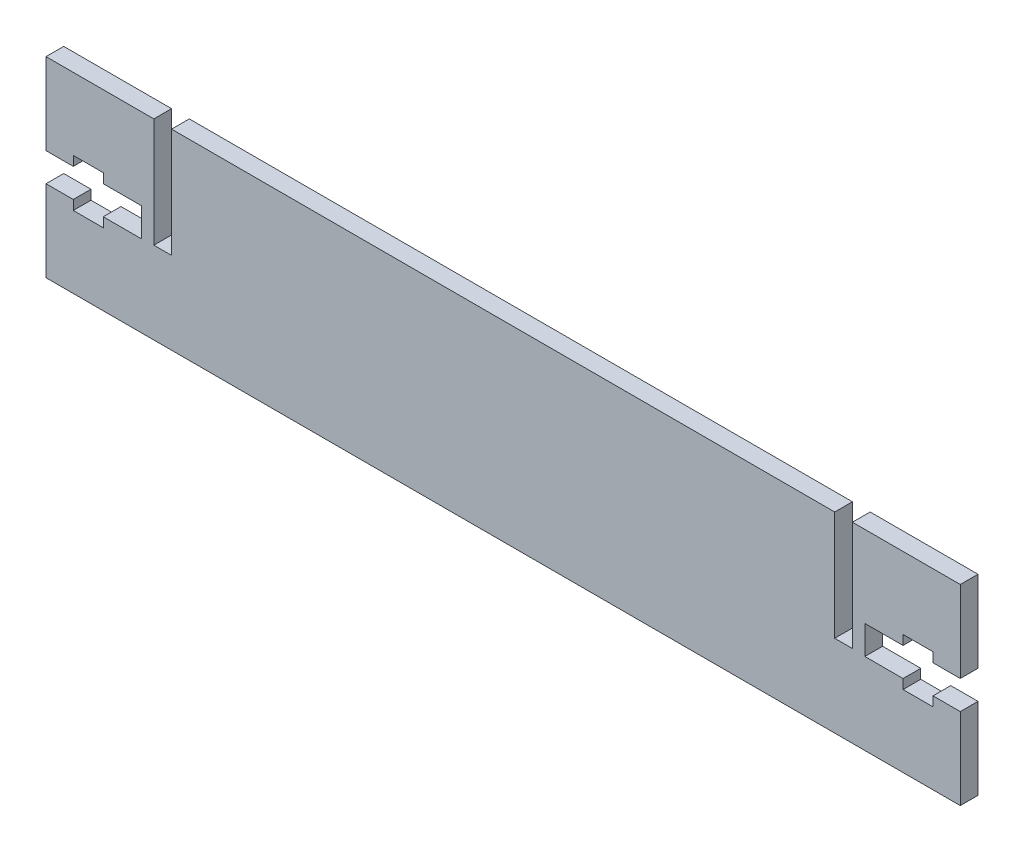
ISO-10303-21;
HEADER;
FILE_DESCRIPTION(('STEP AP214'),'2;1');
FILE_NAME('part.step','',(''),(''),'','','');
FILE_SCHEMA(('AUTOMOTIVE_DESIGN { 1 0 10303 214 1 1 1 1 }'));
ENDSEC;
DATA;
#1=APPLICATION_CONTEXT('core data for automotive mechanical design processes');
#2=APPLICATION_PROTOCOL_DEFINITION('international standard','automotive_design',2000,#1);
#3=PRODUCT_CONTEXT('',#1,'mechanical');
#4=PRODUCT('Part','Part','',(#3));
#5=PRODUCT_RELATED_PRODUCT_CATEGORY('part','',(#4));
#6=PRODUCT_DEFINITION_FORMATION('','',#4);
#7=PRODUCT_DEFINITION_CONTEXT('part definition',#1,'design');
#8=PRODUCT_DEFINITION('design','',#6,#7);
#9=PRODUCT_DEFINITION_SHAPE('','',#8);
#10=(LENGTH_UNIT() NAMED_UNIT(*) SI_UNIT(.MILLI.,.METRE.));
#11=(NAMED_UNIT(*) PLANE_ANGLE_UNIT() SI_UNIT($,.RADIAN.));
#12=(NAMED_UNIT(*) SI_UNIT($,.STERADIAN.) SOLID_ANGLE_UNIT());
#13=UNCERTAINTY_MEASURE_WITH_UNIT(LENGTH_MEASURE(1.E-05),#10,'distance_accuracy_value','');
#14=(GEOMETRIC_REPRESENTATION_CONTEXT(3) GLOBAL_UNCERTAINTY_ASSIGNED_CONTEXT((#13)) GLOBAL_UNIT_ASSIGNED_CONTEXT((#10,
#11,#12)) REPRESENTATION_CONTEXT('',''));
#15=CARTESIAN_POINT('',(0.,0.,0.));
#16=DIRECTION('',(0.,0.,1.));
#17=DIRECTION('',(1.,0.,0.));
#18=AXIS2_PLACEMENT_3D('',#15,#16,#17);
#19=CARTESIAN_POINT('',(-85.181948,0.,1.651));
#20=DIRECTION('',(1.,0.,0.));
#21=DIRECTION('',(0.,0.,-1.));
#22=AXIS2_PLACEMENT_3D('',#19,#20,#21);
#23=PLANE('',#22);
#24=DIRECTION('',(0.,-1.,0.));
#25=VECTOR('',#24,1.);
#26=CARTESIAN_POINT('',(-85.181948,0.,-1.651));
#27=LINE('',#26,#25);
#28=CARTESIAN_POINT('',(-85.181948,17.8435,-1.651));
#29=VERTEX_POINT('',#28);
#30=CARTESIAN_POINT('',(-85.181948,2.66699999999998,-1.651));
#31=VERTEX_POINT('',#30);
#32=EDGE_CURVE('E291',#29,#31,#27,.T.);
#33=ORIENTED_EDGE('',*,*,#32,.T.);
#34=DIRECTION('',(0.,0.,1.));
#35=VECTOR('',#34,1.);
#36=CARTESIAN_POINT('',(-85.181948,2.66699999999998,-1.651));
#37=LINE('',#36,#35);
#38=CARTESIAN_POINT('',(-85.181948,2.66699999999998,1.651));
#39=VERTEX_POINT('',#38);
#40=EDGE_CURVE('E445',#31,#39,#37,.T.);
#41=ORIENTED_EDGE('',*,*,#40,.T.);
#42=DIRECTION('',(0.,-1.,0.));
#43=VECTOR('',#42,1.);
#44=CARTESIAN_POINT('',(-85.181948,0.,1.651));
#45=LINE('',#44,#43);
#46=CARTESIAN_POINT('',(-85.181948,17.8435,1.651));
#47=VERTEX_POINT('',#46);
#48=EDGE_CURVE('E372',#47,#39,#45,.T.);
#49=ORIENTED_EDGE('',*,*,#48,.F.);
#50=DIRECTION('',(0.,0.,-1.));
#51=VECTOR('',#50,1.);
#52=CARTESIAN_POINT('',(-85.181948,17.8435,1.651));
#53=LINE('',#52,#51);
#54=EDGE_CURVE('E329',#47,#29,#53,.T.);
#55=ORIENTED_EDGE('',*,*,#54,.T.);
#56=EDGE_LOOP('',(#33,#41,#49,#55));
#57=FACE_BOUND('',#56,.T.);
#58=ADVANCED_FACE('F35',(#57),#23,.F.);
#59=CARTESIAN_POINT('',(85.181948,0.,1.651));
#60=DIRECTION('',(1.,0.,0.));
#61=DIRECTION('',(0.,0.,-1.));
#62=AXIS2_PLACEMENT_3D('',#59,#60,#61);
#63=PLANE('',#62);
#64=DIRECTION('',(0.,0.,1.));
#65=VECTOR('',#64,1.);
#66=CARTESIAN_POINT('',(85.181948,-2.667,-1.651));
#67=LINE('',#66,#65);
#68=CARTESIAN_POINT('',(85.181948,-2.667,-1.651));
#69=VERTEX_POINT('',#68);
#70=CARTESIAN_POINT('',(85.181948,-2.667,1.651));
#71=VERTEX_POINT('',#70);
#72=EDGE_CURVE('E360',#69,#71,#67,.T.);
#73=ORIENTED_EDGE('',*,*,#72,.T.);
#74=DIRECTION('',(0.,-1.,0.));
#75=VECTOR('',#74,1.);
#76=CARTESIAN_POINT('',(85.181948,0.,1.651));
#77=LINE('',#76,#75);
#78=CARTESIAN_POINT('',(85.181948,-17.8435,1.651));
#79=VERTEX_POINT('',#78);
#80=EDGE_CURVE('E368',#71,#79,#77,.T.);
#81=ORIENTED_EDGE('',*,*,#80,.T.);
#82=DIRECTION('',(0.,0.,-1.));
#83=VECTOR('',#82,1.);
#84=CARTESIAN_POINT('',(85.181948,-17.8435,1.651));
#85=LINE('',#84,#83);
#86=CARTESIAN_POINT('',(85.181948,-17.8435,-1.651));
#87=VERTEX_POINT('',#86);
#88=EDGE_CURVE('E324',#79,#87,#85,.T.);
#89=ORIENTED_EDGE('',*,*,#88,.T.);
#90=DIRECTION('',(0.,-1.,0.));
#91=VECTOR('',#90,1.);
#92=CARTESIAN_POINT('',(85.181948,0.,-1.651));
#93=LINE('',#92,#91);
#94=EDGE_CURVE('E303',#69,#87,#93,.T.);
#95=ORIENTED_EDGE('',*,*,#94,.F.);
#96=EDGE_LOOP('',(#73,#81,#89,#95));
#97=FACE_BOUND('',#96,.T.);
#98=ADVANCED_FACE('F670',(#97),#63,.T.);
#99=CARTESIAN_POINT('',(61.782948,0.,1.651));
#100=DIRECTION('',(1.,0.,0.));
#101=DIRECTION('',(0.,1.,0.));
#102=AXIS2_PLACEMENT_3D('',#99,#100,#101);
#103=PLANE('',#102);
#104=DIRECTION('',(0.,-1.,0.));
#105=VECTOR('',#104,1.);
#106=CARTESIAN_POINT('',(61.782948,0.,-1.651));
#107=LINE('',#106,#105);
#108=CARTESIAN_POINT('',(61.782948,17.8435,-1.651));
#109=VERTEX_POINT('',#108);
#110=CARTESIAN_POINT('',(61.782948,-2.54,-1.651));
#111=VERTEX_POINT('',#110);
#112=EDGE_CURVE('E357',#109,#111,#107,.T.);
#113=ORIENTED_EDGE('',*,*,#112,.F.);
#114=DIRECTION('',(0.,0.,-1.));
#115=VECTOR('',#114,1.);
#116=CARTESIAN_POINT('',(61.782948,17.8435,1.651));
#117=LINE('',#116,#115);
#118=CARTESIAN_POINT('',(61.782948,17.8435,1.651));
#119=VERTEX_POINT('',#118);
#120=EDGE_CURVE('E11',#119,#109,#117,.T.);
#121=ORIENTED_EDGE('',*,*,#120,.F.);
#122=DIRECTION('',(0.,-1.,0.));
#123=VECTOR('',#122,1.);
#124=CARTESIAN_POINT('',(61.782948,0.,1.651));
#125=LINE('',#124,#123);
#126=CARTESIAN_POINT('',(61.782948,-2.54,1.651));
#127=VERTEX_POINT('',#126);
#128=EDGE_CURVE('E312',#119,#127,#125,.T.);
#129=ORIENTED_EDGE('',*,*,#128,.T.);
#130=DIRECTION('',(0.,0.,-1.));
#131=VECTOR('',#130,1.);
#132=CARTESIAN_POINT('',(61.782948,-2.54,1.651));
#133=LINE('',#132,#131);
#134=EDGE_CURVE('E313',#127,#111,#133,.T.);
#135=ORIENTED_EDGE('',*,*,#134,.T.);
#136=EDGE_LOOP('',(#113,#121,#129,#135));
#137=FACE_BOUND('',#136,.T.);
#138=ADVANCED_FACE('F37',(#137),#103,.T.);
#139=CARTESIAN_POINT('',(0.,17.8435,1.651));
#140=DIRECTION('',(0.,-1.,0.));
#141=DIRECTION('',(0.,0.,-1.));
#142=AXIS2_PLACEMENT_3D('',#139,#140,#141);
#143=PLANE('',#142);
#144=DIRECTION('',(-1.,0.,0.));
#145=VECTOR('',#144,1.);
#146=CARTESIAN_POINT('',(0.,17.8435,-1.651));
#147=LINE('',#146,#145);
#148=CARTESIAN_POINT('',(-61.782948,17.8435,-1.651));
#149=VERTEX_POINT('',#148);
#150=EDGE_CURVE('E297',#109,#149,#147,.T.);
#151=ORIENTED_EDGE('',*,*,#150,.T.);
#152=DIRECTION('',(0.,0.,-1.));
#153=VECTOR('',#152,1.);
#154=CARTESIAN_POINT('',(-61.782948,17.8435,1.651));
#155=LINE('',#154,#153);
#156=CARTESIAN_POINT('',(-61.782948,17.8435,1.651));
#157=VERTEX_POINT('',#156);
#158=EDGE_CURVE('E43',#157,#149,#155,.T.);
#159=ORIENTED_EDGE('',*,*,#158,.F.);
#160=DIRECTION('',(-1.,0.,0.));
#161=VECTOR('',#160,1.);
#162=CARTESIAN_POINT('',(0.,17.8435,1.651));
#163=LINE('',#162,#161);
#164=EDGE_CURVE('E383',#119,#157,#163,.T.);
#165=ORIENTED_EDGE('',*,*,#164,.F.);
#166=ORIENTED_EDGE('',*,*,#120,.T.);
#167=EDGE_LOOP('',(#151,#159,#165,#166));
#168=FACE_BOUND('',#167,.T.);
#169=ADVANCED_FACE('F605',(#168),#143,.F.);
#170=CARTESIAN_POINT('',(-61.782948,1.05159889430818E-13,1.651));
#171=DIRECTION('',(1.,0.,0.));
#172=DIRECTION('',(0.,1.,0.));
#173=AXIS2_PLACEMENT_3D('',#170,#171,#172);
#174=PLANE('',#173);
#175=DIRECTION('',(0.,-1.,0.));
#176=VECTOR('',#175,1.);
#177=CARTESIAN_POINT('',(-61.782948,1.05159889430818E-13,-1.651));
#178=LINE('',#177,#176);
#179=CARTESIAN_POINT('',(-61.782948,-2.54,-1.651));
#180=VERTEX_POINT('',#179);
#181=EDGE_CURVE('E345',#149,#180,#178,.T.);
#182=ORIENTED_EDGE('',*,*,#181,.T.);
#183=DIRECTION('',(0.,0.,-1.));
#184=VECTOR('',#183,1.);
#185=CARTESIAN_POINT('',(-61.782948,-2.54,1.651));
#186=LINE('',#185,#184);
#187=CARTESIAN_POINT('',(-61.782948,-2.54,1.651));
#188=VERTEX_POINT('',#187);
#189=EDGE_CURVE('E336',#188,#180,#186,.T.);
#190=ORIENTED_EDGE('',*,*,#189,.F.);
#191=DIRECTION('',(0.,-1.,0.));
#192=VECTOR('',#191,1.);
#193=CARTESIAN_POINT('',(-61.782948,1.05159889430818E-13,1.651));
#194=LINE('',#193,#192);
#195=EDGE_CURVE('E347',#157,#188,#194,.T.);
#196=ORIENTED_EDGE('',*,*,#195,.F.);
#197=ORIENTED_EDGE('',*,*,#158,.T.);
#198=EDGE_LOOP('',(#182,#190,#196,#197));
#199=FACE_BOUND('',#198,.T.);
#200=ADVANCED_FACE('F343',(#199),#174,.F.);
#201=CARTESIAN_POINT('',(0.,-2.54,1.651));
#202=DIRECTION('',(0.,1.,0.));
#203=DIRECTION('',(0.,0.,1.));
#204=AXIS2_PLACEMENT_3D('',#201,#202,#203);
#205=PLANE('',#204);
#206=DIRECTION('',(1.,0.,0.));
#207=VECTOR('',#206,1.);
#208=CARTESIAN_POINT('',(0.,-2.54,-1.651));
#209=LINE('',#208,#207);
#210=CARTESIAN_POINT('',(-65.084948,-2.54,-1.651));
#211=VERTEX_POINT('',#210);
#212=EDGE_CURVE('E355',#211,#180,#209,.T.);
#213=ORIENTED_EDGE('',*,*,#212,.F.);
#214=DIRECTION('',(0.,0.,-1.));
#215=VECTOR('',#214,1.);
#216=CARTESIAN_POINT('',(-65.084948,-2.54,1.651));
#217=LINE('',#216,#215);
#218=CARTESIAN_POINT('',(-65.084948,-2.54,1.651));
#219=VERTEX_POINT('',#218);
#220=EDGE_CURVE('E334',#219,#211,#217,.T.);
#221=ORIENTED_EDGE('',*,*,#220,.F.);
#222=DIRECTION('',(1.,0.,0.));
#223=VECTOR('',#222,1.);
#224=CARTESIAN_POINT('',(0.,-2.54,1.651));
#225=LINE('',#224,#223);
#226=EDGE_CURVE('E379',#219,#188,#225,.T.);
#227=ORIENTED_EDGE('',*,*,#226,.T.);
#228=ORIENTED_EDGE('',*,*,#189,.T.);
#229=EDGE_LOOP('',(#213,#221,#227,#228));
#230=FACE_BOUND('',#229,.T.);
#231=ADVANCED_FACE('F601',(#230),#205,.T.);
#232=CARTESIAN_POINT('',(-65.084948,0.,1.651));
#233=DIRECTION('',(1.,0.,0.));
#234=DIRECTION('',(0.,0.,-1.));
#235=AXIS2_PLACEMENT_3D('',#232,#233,#234);
#236=PLANE('',#235);
#237=DIRECTION('',(0.,-1.,0.));
#238=VECTOR('',#237,1.);
#239=CARTESIAN_POINT('',(-65.084948,0.,-1.651));
#240=LINE('',#239,#238);
#241=CARTESIAN_POINT('',(-65.084948,17.8435,-1.651));
#242=VERTEX_POINT('',#241);
#243=EDGE_CURVE('E295',#242,#211,#240,.T.);
#244=ORIENTED_EDGE('',*,*,#243,.F.);
#245=DIRECTION('',(0.,0.,-1.));
#246=VECTOR('',#245,1.);
#247=CARTESIAN_POINT('',(-65.084948,17.8435,1.651));
#248=LINE('',#247,#246);
#249=CARTESIAN_POINT('',(-65.084948,17.8435,1.651));
#250=VERTEX_POINT('',#249);
#251=EDGE_CURVE('E332',#250,#242,#248,.T.);
#252=ORIENTED_EDGE('',*,*,#251,.F.);
#253=DIRECTION('',(0.,-1.,0.));
#254=VECTOR('',#253,1.);
#255=CARTESIAN_POINT('',(-65.084948,0.,1.651));
#256=LINE('',#255,#254);
#257=EDGE_CURVE('E375',#250,#219,#256,.T.);
#258=ORIENTED_EDGE('',*,*,#257,.T.);
#259=ORIENTED_EDGE('',*,*,#220,.T.);
#260=EDGE_LOOP('',(#244,#252,#258,#259));
#261=FACE_BOUND('',#260,.T.);
#262=ADVANCED_FACE('F598',(#261),#236,.T.);
#263=EDGE_CURVE('E292',#242,#29,#147,.T.);
#264=ORIENTED_EDGE('',*,*,#263,.T.);
#265=ORIENTED_EDGE('',*,*,#54,.F.);
#266=EDGE_CURVE('E378',#250,#47,#163,.T.);
#267=ORIENTED_EDGE('',*,*,#266,.F.);
#268=ORIENTED_EDGE('',*,*,#251,.T.);
#269=EDGE_LOOP('',(#264,#265,#267,#268));
#270=FACE_BOUND('',#269,.T.);
#271=ADVANCED_FACE('F594',(#270),#143,.F.);
#272=CARTESIAN_POINT('',(-85.181948,-2.66699999999998,1.651));
#273=VERTEX_POINT('',#272);
#274=CARTESIAN_POINT('',(-85.181948,-17.8435,1.651));
#275=VERTEX_POINT('',#274);
#276=EDGE_CURVE('E283',#273,#275,#45,.T.);
#277=ORIENTED_EDGE('',*,*,#276,.F.);
#278=DIRECTION('',(0.,0.,1.));
#279=VECTOR('',#278,1.);
#280=CARTESIAN_POINT('',(-85.181948,-2.66699999999998,-1.651));
#281=LINE('',#280,#279);
#282=CARTESIAN_POINT('',(-85.181948,-2.66699999999998,-1.651));
#283=VERTEX_POINT('',#282);
#284=EDGE_CURVE('E270',#283,#273,#281,.T.);
#285=ORIENTED_EDGE('',*,*,#284,.F.);
#286=CARTESIAN_POINT('',(-85.181948,-17.8435,-1.651));
#287=VERTEX_POINT('',#286);
#288=EDGE_CURVE('E281',#283,#287,#27,.T.);
#289=ORIENTED_EDGE('',*,*,#288,.T.);
#290=DIRECTION('',(0.,0.,-1.));
#291=VECTOR('',#290,1.);
#292=CARTESIAN_POINT('',(-85.181948,-17.8435,1.651));
#293=LINE('',#292,#291);
#294=EDGE_CURVE('E327',#275,#287,#293,.T.);
#295=ORIENTED_EDGE('',*,*,#294,.F.);
#296=EDGE_LOOP('',(#277,#285,#289,#295));
#297=FACE_BOUND('',#296,.T.);
#298=ADVANCED_FACE('F279',(#297),#23,.F.);
#299=CARTESIAN_POINT('',(0.,-17.8435,1.651));
#300=DIRECTION('',(0.,-1.,0.));
#301=DIRECTION('',(1.,0.,0.));
#302=AXIS2_PLACEMENT_3D('',#299,#300,#301);
#303=PLANE('',#302);
#304=DIRECTION('',(-1.,0.,0.));
#305=VECTOR('',#304,1.);
#306=CARTESIAN_POINT('',(0.,-17.8435,-1.651));
#307=LINE('',#306,#305);
#308=EDGE_CURVE('E290',#87,#287,#307,.T.);
#309=ORIENTED_EDGE('',*,*,#308,.F.);
#310=ORIENTED_EDGE('',*,*,#88,.F.);
#311=DIRECTION('',(-1.,0.,0.));
#312=VECTOR('',#311,1.);
#313=CARTESIAN_POINT('',(0.,-17.8435,1.651));
#314=LINE('',#313,#312);
#315=EDGE_CURVE('E369',#79,#275,#314,.T.);
#316=ORIENTED_EDGE('',*,*,#315,.T.);
#317=ORIENTED_EDGE('',*,*,#294,.T.);
#318=EDGE_LOOP('',(#309,#310,#316,#317));
#319=FACE_BOUND('',#318,.T.);
#320=ADVANCED_FACE('F675',(#319),#303,.T.);
#321=DIRECTION('',(0.,0.,1.));
#322=VECTOR('',#321,1.);
#323=CARTESIAN_POINT('',(85.181948,2.667,-1.651));
#324=LINE('',#323,#322);
#325=CARTESIAN_POINT('',(85.181948,2.667,-1.651));
#326=VERTEX_POINT('',#325);
#327=CARTESIAN_POINT('',(85.181948,2.667,1.651));
#328=VERTEX_POINT('',#327);
#329=EDGE_CURVE('E387',#326,#328,#324,.T.);
#330=ORIENTED_EDGE('',*,*,#329,.F.);
#331=CARTESIAN_POINT('',(85.181948,17.8435,-1.651));
#332=VERTEX_POINT('',#331);
#333=EDGE_CURVE('E304',#332,#326,#93,.T.);
#334=ORIENTED_EDGE('',*,*,#333,.F.);
#335=DIRECTION('',(0.,0.,-1.));
#336=VECTOR('',#335,1.);
#337=CARTESIAN_POINT('',(85.181948,17.8435,1.651));
#338=LINE('',#337,#336);
#339=CARTESIAN_POINT('',(85.181948,17.8435,1.651));
#340=VERTEX_POINT('',#339);
#341=EDGE_CURVE('E322',#340,#332,#338,.T.);
#342=ORIENTED_EDGE('',*,*,#341,.F.);
#343=EDGE_CURVE('E365',#340,#328,#77,.T.);
#344=ORIENTED_EDGE('',*,*,#343,.T.);
#345=EDGE_LOOP('',(#330,#334,#342,#344));
#346=FACE_BOUND('',#345,.T.);
#347=ADVANCED_FACE('F626',(#346),#63,.T.);
#348=CARTESIAN_POINT('',(65.084948,17.8435,-1.651));
#349=VERTEX_POINT('',#348);
#350=EDGE_CURVE('E298',#332,#349,#147,.T.);
#351=ORIENTED_EDGE('',*,*,#350,.T.);
#352=DIRECTION('',(0.,0.,-1.));
#353=VECTOR('',#352,1.);
#354=CARTESIAN_POINT('',(65.084948,17.8435,1.651));
#355=LINE('',#354,#353);
#356=CARTESIAN_POINT('',(65.084948,17.8435,1.651));
#357=VERTEX_POINT('',#356);
#358=EDGE_CURVE('E319',#357,#349,#355,.T.);
#359=ORIENTED_EDGE('',*,*,#358,.F.);
#360=EDGE_CURVE('E364',#340,#357,#163,.T.);
#361=ORIENTED_EDGE('',*,*,#360,.F.);
#362=ORIENTED_EDGE('',*,*,#341,.T.);
#363=EDGE_LOOP('',(#351,#359,#361,#362));
#364=FACE_BOUND('',#363,.T.);
#365=ADVANCED_FACE('F621',(#364),#143,.F.);
#366=CARTESIAN_POINT('',(65.084948,0.,1.651));
#367=DIRECTION('',(1.,0.,0.));
#368=DIRECTION('',(0.,0.,-1.));
#369=AXIS2_PLACEMENT_3D('',#366,#367,#368);
#370=PLANE('',#369);
#371=DIRECTION('',(0.,-1.,0.));
#372=VECTOR('',#371,1.);
#373=CARTESIAN_POINT('',(65.084948,0.,-1.651));
#374=LINE('',#373,#372);
#375=CARTESIAN_POINT('',(65.084948,-2.54,-1.651));
#376=VERTEX_POINT('',#375);
#377=EDGE_CURVE('E307',#349,#376,#374,.T.);
#378=ORIENTED_EDGE('',*,*,#377,.T.);
#379=DIRECTION('',(0.,0.,-1.));
#380=VECTOR('',#379,1.);
#381=CARTESIAN_POINT('',(65.084948,-2.54,1.651));
#382=LINE('',#381,#380);
#383=CARTESIAN_POINT('',(65.084948,-2.54,1.651));
#384=VERTEX_POINT('',#383);
#385=EDGE_CURVE('E315',#384,#376,#382,.T.);
#386=ORIENTED_EDGE('',*,*,#385,.F.);
#387=DIRECTION('',(0.,-1.,0.));
#388=VECTOR('',#387,1.);
#389=CARTESIAN_POINT('',(65.084948,0.,1.651));
#390=LINE('',#389,#388);
#391=EDGE_CURVE('E362',#357,#384,#390,.T.);
#392=ORIENTED_EDGE('',*,*,#391,.F.);
#393=ORIENTED_EDGE('',*,*,#358,.T.);
#394=EDGE_LOOP('',(#378,#386,#392,#393));
#395=FACE_BOUND('',#394,.T.);
#396=ADVANCED_FACE('F617',(#395),#370,.F.);
#397=CARTESIAN_POINT('',(0.,-2.54,1.651));
#398=DIRECTION('',(0.,-1.,0.));
#399=DIRECTION('',(0.,0.,-1.));
#400=AXIS2_PLACEMENT_3D('',#397,#398,#399);
#401=PLANE('',#400);
#402=DIRECTION('',(-1.,0.,0.));
#403=VECTOR('',#402,1.);
#404=CARTESIAN_POINT('',(0.,-2.54,-1.651));
#405=LINE('',#404,#403);
#406=EDGE_CURVE('E309',#376,#111,#405,.T.);
#407=ORIENTED_EDGE('',*,*,#406,.T.);
#408=ORIENTED_EDGE('',*,*,#134,.F.);
#409=DIRECTION('',(-1.,0.,0.));
#410=VECTOR('',#409,1.);
#411=CARTESIAN_POINT('',(0.,-2.54,1.651));
#412=LINE('',#411,#410);
#413=EDGE_CURVE('E316',#384,#127,#412,.T.);
#414=ORIENTED_EDGE('',*,*,#413,.F.);
#415=ORIENTED_EDGE('',*,*,#385,.T.);
#416=EDGE_LOOP('',(#407,#408,#414,#415));
#417=FACE_BOUND('',#416,.T.);
#418=ADVANCED_FACE('F612',(#417),#401,.F.);
#419=CARTESIAN_POINT('',(0.,0.,1.651));
#420=DIRECTION('',(0.,0.,1.));
#421=DIRECTION('',(1.,0.,0.));
#422=AXIS2_PLACEMENT_3D('',#419,#420,#421);
#423=PLANE('',#422);
#424=DIRECTION('',(-1.,0.,0.));
#425=VECTOR('',#424,1.);
#426=CARTESIAN_POINT('',(-85.181948,2.66699999999998,1.651));
#427=LINE('',#426,#425);
#428=CARTESIAN_POINT('',(-80.101948,2.66699999999998,1.651));
#429=VERTEX_POINT('',#428);
#430=EDGE_CURVE('E275',#429,#39,#427,.T.);
#431=ORIENTED_EDGE('',*,*,#430,.F.);
#432=DIRECTION('',(0.,-1.,0.));
#433=VECTOR('',#432,1.);
#434=CARTESIAN_POINT('',(-80.101948,2.66699999999998,1.651));
#435=LINE('',#434,#433);
#436=CARTESIAN_POINT('',(-80.101948,4.44499999999998,1.651));
#437=VERTEX_POINT('',#436);
#438=EDGE_CURVE('E497',#437,#429,#435,.T.);
#439=ORIENTED_EDGE('',*,*,#438,.F.);
#440=DIRECTION('',(-1.,0.,0.));
#441=VECTOR('',#440,1.);
#442=CARTESIAN_POINT('',(-80.101948,4.44499999999998,1.651));
#443=LINE('',#442,#441);
#444=CARTESIAN_POINT('',(-74.513948,4.44499999999998,1.651));
#445=VERTEX_POINT('',#444);
#446=EDGE_CURVE('E500',#445,#437,#443,.T.);
#447=ORIENTED_EDGE('',*,*,#446,.F.);
#448=DIRECTION('',(0.,1.,0.));
#449=VECTOR('',#448,1.);
#450=CARTESIAN_POINT('',(-74.513948,4.44499999999998,1.651));
#451=LINE('',#450,#449);
#452=CARTESIAN_POINT('',(-74.513948,2.66699999999998,1.651));
#453=VERTEX_POINT('',#452);
#454=EDGE_CURVE('E503',#453,#445,#451,.T.);
#455=ORIENTED_EDGE('',*,*,#454,.F.);
#456=DIRECTION('',(-1.,0.,0.));
#457=VECTOR('',#456,1.);
#458=CARTESIAN_POINT('',(-74.513948,2.66699999999998,1.651));
#459=LINE('',#458,#457);
#460=CARTESIAN_POINT('',(-67.401948,2.66699999999998,1.651));
#461=VERTEX_POINT('',#460);
#462=EDGE_CURVE('E506',#461,#453,#459,.T.);
#463=ORIENTED_EDGE('',*,*,#462,.F.);
#464=DIRECTION('',(0.,1.,0.));
#465=VECTOR('',#464,1.);
#466=CARTESIAN_POINT('',(-67.401948,2.66699999999998,1.651));
#467=LINE('',#466,#465);
#468=CARTESIAN_POINT('',(-67.401948,-2.66699999999998,1.651));
#469=VERTEX_POINT('',#468);
#470=EDGE_CURVE('E509',#469,#461,#467,.T.);
#471=ORIENTED_EDGE('',*,*,#470,.F.);
#472=DIRECTION('',(1.,0.,0.));
#473=VECTOR('',#472,1.);
#474=CARTESIAN_POINT('',(-74.513948,-2.66699999999998,1.651));
#475=LINE('',#474,#473);
#476=CARTESIAN_POINT('',(-74.513948,-2.66699999999998,1.651));
#477=VERTEX_POINT('',#476);
#478=EDGE_CURVE('E512',#477,#469,#475,.T.);
#479=ORIENTED_EDGE('',*,*,#478,.F.);
#480=DIRECTION('',(0.,1.,0.));
#481=VECTOR('',#480,1.);
#482=CARTESIAN_POINT('',(-74.513948,-4.44499999999998,1.651));
#483=LINE('',#482,#481);
#484=CARTESIAN_POINT('',(-74.513948,-4.44499999999998,1.651));
#485=VERTEX_POINT('',#484);
#486=EDGE_CURVE('E515',#485,#477,#483,.T.);
#487=ORIENTED_EDGE('',*,*,#486,.F.);
#488=DIRECTION('',(1.,0.,0.));
#489=VECTOR('',#488,1.);
#490=CARTESIAN_POINT('',(-80.101948,-4.44499999999998,1.651));
#491=LINE('',#490,#489);
#492=CARTESIAN_POINT('',(-80.101948,-4.44499999999998,1.651));
#493=VERTEX_POINT('',#492);
#494=EDGE_CURVE('E518',#493,#485,#491,.T.);
#495=ORIENTED_EDGE('',*,*,#494,.F.);
#496=DIRECTION('',(0.,-1.,0.));
#497=VECTOR('',#496,1.);
#498=CARTESIAN_POINT('',(-80.101948,-2.66699999999998,1.651));
#499=LINE('',#498,#497);
#500=CARTESIAN_POINT('',(-80.101948,-2.66699999999998,1.651));
#501=VERTEX_POINT('',#500);
#502=EDGE_CURVE('E521',#501,#493,#499,.T.);
#503=ORIENTED_EDGE('',*,*,#502,.F.);
#504=DIRECTION('',(1.,0.,0.));
#505=VECTOR('',#504,1.);
#506=CARTESIAN_POINT('',(-85.181948,-2.66699999999998,1.651));
#507=LINE('',#506,#505);
#508=EDGE_CURVE('E524',#273,#501,#507,.T.);
#509=ORIENTED_EDGE('',*,*,#508,.F.);
#510=ORIENTED_EDGE('',*,*,#276,.T.);
#511=ORIENTED_EDGE('',*,*,#315,.F.);
#512=ORIENTED_EDGE('',*,*,#80,.F.);
#513=DIRECTION('',(1.,0.,0.));
#514=VECTOR('',#513,1.);
#515=CARTESIAN_POINT('',(85.181948,-2.667,1.651));
#516=LINE('',#515,#514);
#517=CARTESIAN_POINT('',(80.101948,-2.667,1.651));
#518=VERTEX_POINT('',#517);
#519=EDGE_CURVE('E412',#518,#71,#516,.T.);
#520=ORIENTED_EDGE('',*,*,#519,.F.);
#521=DIRECTION('',(0.,1.,0.));
#522=VECTOR('',#521,1.);
#523=CARTESIAN_POINT('',(80.101948,-2.667,1.651));
#524=LINE('',#523,#522);
#525=CARTESIAN_POINT('',(80.101948,-4.445,1.651));
#526=VERTEX_POINT('',#525);
#527=EDGE_CURVE('E415',#526,#518,#524,.T.);
#528=ORIENTED_EDGE('',*,*,#527,.F.);
#529=DIRECTION('',(1.,0.,0.));
#530=VECTOR('',#529,1.);
#531=CARTESIAN_POINT('',(80.101948,-4.445,1.651));
#532=LINE('',#531,#530);
#533=CARTESIAN_POINT('',(74.513948,-4.445,1.651));
#534=VERTEX_POINT('',#533);
#535=EDGE_CURVE('E418',#534,#526,#532,.T.);
#536=ORIENTED_EDGE('',*,*,#535,.F.);
#537=DIRECTION('',(0.,-1.,0.));
#538=VECTOR('',#537,1.);
#539=CARTESIAN_POINT('',(74.513948,-4.445,1.651));
#540=LINE('',#539,#538);
#541=CARTESIAN_POINT('',(74.513948,-2.667,1.651));
#542=VERTEX_POINT('',#541);
#543=EDGE_CURVE('E421',#542,#534,#540,.T.);
#544=ORIENTED_EDGE('',*,*,#543,.F.);
#545=DIRECTION('',(1.,0.,0.));
#546=VECTOR('',#545,1.);
#547=CARTESIAN_POINT('',(74.513948,-2.667,1.651));
#548=LINE('',#547,#546);
#549=CARTESIAN_POINT('',(67.401948,-2.667,1.651));
#550=VERTEX_POINT('',#549);
#551=EDGE_CURVE('E424',#550,#542,#548,.T.);
#552=ORIENTED_EDGE('',*,*,#551,.F.);
#553=DIRECTION('',(0.,-1.,0.));
#554=VECTOR('',#553,1.);
#555=CARTESIAN_POINT('',(67.401948,2.667,1.651));
#556=LINE('',#555,#554);
#557=CARTESIAN_POINT('',(67.401948,2.667,1.651));
#558=VERTEX_POINT('',#557);
#559=EDGE_CURVE('E427',#558,#550,#556,.T.);
#560=ORIENTED_EDGE('',*,*,#559,.F.);
#561=DIRECTION('',(-1.,0.,0.));
#562=VECTOR('',#561,1.);
#563=CARTESIAN_POINT('',(74.513948,2.667,1.651));
#564=LINE('',#563,#562);
#565=CARTESIAN_POINT('',(74.513948,2.667,1.651));
#566=VERTEX_POINT('',#565);
#567=EDGE_CURVE('E430',#566,#558,#564,.T.);
#568=ORIENTED_EDGE('',*,*,#567,.F.);
#569=DIRECTION('',(0.,-1.,0.));
#570=VECTOR('',#569,1.);
#571=CARTESIAN_POINT('',(74.513948,4.445,1.651));
#572=LINE('',#571,#570);
#573=CARTESIAN_POINT('',(74.513948,4.445,1.651));
#574=VERTEX_POINT('',#573);
#575=EDGE_CURVE('E433',#574,#566,#572,.T.);
#576=ORIENTED_EDGE('',*,*,#575,.F.);
#577=DIRECTION('',(-1.,0.,0.));
#578=VECTOR('',#577,1.);
#579=CARTESIAN_POINT('',(80.101948,4.445,1.651));
#580=LINE('',#579,#578);
#581=CARTESIAN_POINT('',(80.101948,4.445,1.651));
#582=VERTEX_POINT('',#581);
#583=EDGE_CURVE('E436',#582,#574,#580,.T.);
#584=ORIENTED_EDGE('',*,*,#583,.F.);
#585=DIRECTION('',(0.,1.,0.));
#586=VECTOR('',#585,1.);
#587=CARTESIAN_POINT('',(80.101948,2.667,1.651));
#588=LINE('',#587,#586);
#589=CARTESIAN_POINT('',(80.101948,2.667,1.651));
#590=VERTEX_POINT('',#589);
#591=EDGE_CURVE('E439',#590,#582,#588,.T.);
#592=ORIENTED_EDGE('',*,*,#591,.F.);
#593=DIRECTION('',(-1.,0.,0.));
#594=VECTOR('',#593,1.);
#595=CARTESIAN_POINT('',(85.181948,2.667,1.651));
#596=LINE('',#595,#594);
#597=EDGE_CURVE('E442',#328,#590,#596,.T.);
#598=ORIENTED_EDGE('',*,*,#597,.F.);
#599=ORIENTED_EDGE('',*,*,#343,.F.);
#600=ORIENTED_EDGE('',*,*,#360,.T.);
#601=ORIENTED_EDGE('',*,*,#391,.T.);
#602=ORIENTED_EDGE('',*,*,#413,.T.);
#603=ORIENTED_EDGE('',*,*,#128,.F.);
#604=ORIENTED_EDGE('',*,*,#164,.T.);
#605=ORIENTED_EDGE('',*,*,#195,.T.);
#606=ORIENTED_EDGE('',*,*,#226,.F.);
#607=ORIENTED_EDGE('',*,*,#257,.F.);
#608=ORIENTED_EDGE('',*,*,#266,.T.);
#609=ORIENTED_EDGE('',*,*,#48,.T.);
#610=EDGE_LOOP('',(#431,#439,#447,#455,#463,#471,#479,#487,#495,#503,#509,#510,#511,#512,#520,
#528,#536,#544,#552,#560,#568,#576,#584,#592,#598,#599,#600,#601,#602,#603,#604,#605,#606,#607,
#608,#609));
#611=FACE_BOUND('',#610,.T.);
#612=ADVANCED_FACE('F603',(#611),#423,.T.);
#613=CARTESIAN_POINT('',(0.,0.,-1.651));
#614=DIRECTION('',(0.,0.,1.));
#615=DIRECTION('',(1.,0.,0.));
#616=AXIS2_PLACEMENT_3D('',#613,#614,#615);
#617=PLANE('',#616);
#618=DIRECTION('',(0.,-1.,0.));
#619=VECTOR('',#618,1.);
#620=CARTESIAN_POINT('',(-80.101948,2.66699999999998,-1.651));
#621=LINE('',#620,#619);
#622=CARTESIAN_POINT('',(-80.101948,4.44499999999998,-1.651));
#623=VERTEX_POINT('',#622);
#624=CARTESIAN_POINT('',(-80.101948,2.66699999999998,-1.651));
#625=VERTEX_POINT('',#624);
#626=EDGE_CURVE('E528',#623,#625,#621,.T.);
#627=ORIENTED_EDGE('',*,*,#626,.T.);
#628=DIRECTION('',(-1.,0.,0.));
#629=VECTOR('',#628,1.);
#630=CARTESIAN_POINT('',(-85.181948,2.66699999999998,-1.651));
#631=LINE('',#630,#629);
#632=EDGE_CURVE('E284',#625,#31,#631,.T.);
#633=ORIENTED_EDGE('',*,*,#632,.T.);
#634=ORIENTED_EDGE('',*,*,#32,.F.);
#635=ORIENTED_EDGE('',*,*,#263,.F.);
#636=ORIENTED_EDGE('',*,*,#243,.T.);
#637=ORIENTED_EDGE('',*,*,#212,.T.);
#638=ORIENTED_EDGE('',*,*,#181,.F.);
#639=ORIENTED_EDGE('',*,*,#150,.F.);
#640=ORIENTED_EDGE('',*,*,#112,.T.);
#641=ORIENTED_EDGE('',*,*,#406,.F.);
#642=ORIENTED_EDGE('',*,*,#377,.F.);
#643=ORIENTED_EDGE('',*,*,#350,.F.);
#644=ORIENTED_EDGE('',*,*,#333,.T.);
#645=DIRECTION('',(-1.,0.,0.));
#646=VECTOR('',#645,1.);
#647=CARTESIAN_POINT('',(85.181948,2.667,-1.651));
#648=LINE('',#647,#646);
#649=CARTESIAN_POINT('',(80.101948,2.667,-1.651));
#650=VERTEX_POINT('',#649);
#651=EDGE_CURVE('E414',#326,#650,#648,.T.);
#652=ORIENTED_EDGE('',*,*,#651,.T.);
#653=DIRECTION('',(0.,1.,0.));
#654=VECTOR('',#653,1.);
#655=CARTESIAN_POINT('',(80.101948,2.667,-1.651));
#656=LINE('',#655,#654);
#657=CARTESIAN_POINT('',(80.101948,4.445,-1.651));
#658=VERTEX_POINT('',#657);
#659=EDGE_CURVE('E58',#650,#658,#656,.T.);
#660=ORIENTED_EDGE('',*,*,#659,.T.);
#661=DIRECTION('',(-1.,0.,0.));
#662=VECTOR('',#661,1.);
#663=CARTESIAN_POINT('',(80.101948,4.445,-1.651));
#664=LINE('',#663,#662);
#665=CARTESIAN_POINT('',(74.513948,4.445,-1.651));
#666=VERTEX_POINT('',#665);
#667=EDGE_CURVE('E469',#658,#666,#664,.T.);
#668=ORIENTED_EDGE('',*,*,#667,.T.);
#669=DIRECTION('',(0.,-1.,0.));
#670=VECTOR('',#669,1.);
#671=CARTESIAN_POINT('',(74.513948,4.445,-1.651));
#672=LINE('',#671,#670);
#673=CARTESIAN_POINT('',(74.513948,2.667,-1.651));
#674=VERTEX_POINT('',#673);
#675=EDGE_CURVE('E466',#666,#674,#672,.T.);
#676=ORIENTED_EDGE('',*,*,#675,.T.);
#677=DIRECTION('',(-1.,0.,0.));
#678=VECTOR('',#677,1.);
#679=CARTESIAN_POINT('',(74.513948,2.667,-1.651));
#680=LINE('',#679,#678);
#681=CARTESIAN_POINT('',(67.401948,2.667,-1.651));
#682=VERTEX_POINT('',#681);
#683=EDGE_CURVE('E463',#674,#682,#680,.T.);
#684=ORIENTED_EDGE('',*,*,#683,.T.);
#685=DIRECTION('',(0.,-1.,0.));
#686=VECTOR('',#685,1.);
#687=CARTESIAN_POINT('',(67.401948,2.667,-1.651));
#688=LINE('',#687,#686);
#689=CARTESIAN_POINT('',(67.401948,-2.667,-1.651));
#690=VERTEX_POINT('',#689);
#691=EDGE_CURVE('E460',#682,#690,#688,.T.);
#692=ORIENTED_EDGE('',*,*,#691,.T.);
#693=DIRECTION('',(1.,0.,0.));
#694=VECTOR('',#693,1.);
#695=CARTESIAN_POINT('',(74.513948,-2.667,-1.651));
#696=LINE('',#695,#694);
#697=CARTESIAN_POINT('',(74.513948,-2.667,-1.651));
#698=VERTEX_POINT('',#697);
#699=EDGE_CURVE('E457',#690,#698,#696,.T.);
#700=ORIENTED_EDGE('',*,*,#699,.T.);
#701=DIRECTION('',(0.,-1.,0.));
#702=VECTOR('',#701,1.);
#703=CARTESIAN_POINT('',(74.513948,-4.445,-1.651));
#704=LINE('',#703,#702);
#705=CARTESIAN_POINT('',(74.513948,-4.445,-1.651));
#706=VERTEX_POINT('',#705);
#707=EDGE_CURVE('E454',#698,#706,#704,.T.);
#708=ORIENTED_EDGE('',*,*,#707,.T.);
#709=DIRECTION('',(1.,0.,0.));
#710=VECTOR('',#709,1.);
#711=CARTESIAN_POINT('',(80.101948,-4.445,-1.651));
#712=LINE('',#711,#710);
#713=CARTESIAN_POINT('',(80.101948,-4.445,-1.651));
#714=VERTEX_POINT('',#713);
#715=EDGE_CURVE('E451',#706,#714,#712,.T.);
#716=ORIENTED_EDGE('',*,*,#715,.T.);
#717=DIRECTION('',(0.,1.,0.));
#718=VECTOR('',#717,1.);
#719=CARTESIAN_POINT('',(80.101948,-2.667,-1.651));
#720=LINE('',#719,#718);
#721=CARTESIAN_POINT('',(80.101948,-2.667,-1.651));
#722=VERTEX_POINT('',#721);
#723=EDGE_CURVE('E448',#714,#722,#720,.T.);
#724=ORIENTED_EDGE('',*,*,#723,.T.);
#725=DIRECTION('',(1.,0.,0.));
#726=VECTOR('',#725,1.);
#727=CARTESIAN_POINT('',(85.181948,-2.667,-1.651));
#728=LINE('',#727,#726);
#729=EDGE_CURVE('E390',#722,#69,#728,.T.);
#730=ORIENTED_EDGE('',*,*,#729,.T.);
#731=ORIENTED_EDGE('',*,*,#94,.T.);
#732=ORIENTED_EDGE('',*,*,#308,.T.);
#733=ORIENTED_EDGE('',*,*,#288,.F.);
#734=DIRECTION('',(1.,0.,0.));
#735=VECTOR('',#734,1.);
#736=CARTESIAN_POINT('',(-85.181948,-2.66699999999998,-1.651));
#737=LINE('',#736,#735);
#738=CARTESIAN_POINT('',(-80.101948,-2.66699999999998,-1.651));
#739=VERTEX_POINT('',#738);
#740=EDGE_CURVE('E266',#283,#739,#737,.T.);
#741=ORIENTED_EDGE('',*,*,#740,.T.);
#742=DIRECTION('',(0.,-1.,0.));
#743=VECTOR('',#742,1.);
#744=CARTESIAN_POINT('',(-80.101948,-2.66699999999998,-1.651));
#745=LINE('',#744,#743);
#746=CARTESIAN_POINT('',(-80.101948,-4.44499999999998,-1.651));
#747=VERTEX_POINT('',#746);
#748=EDGE_CURVE('E50',#739,#747,#745,.T.);
#749=ORIENTED_EDGE('',*,*,#748,.T.);
#750=DIRECTION('',(1.,0.,0.));
#751=VECTOR('',#750,1.);
#752=CARTESIAN_POINT('',(-80.101948,-4.44499999999998,-1.651));
#753=LINE('',#752,#751);
#754=CARTESIAN_POINT('',(-74.513948,-4.44499999999998,-1.651));
#755=VERTEX_POINT('',#754);
#756=EDGE_CURVE('E548',#747,#755,#753,.T.);
#757=ORIENTED_EDGE('',*,*,#756,.T.);
#758=DIRECTION('',(0.,1.,0.));
#759=VECTOR('',#758,1.);
#760=CARTESIAN_POINT('',(-74.513948,-4.44499999999998,-1.651));
#761=LINE('',#760,#759);
#762=CARTESIAN_POINT('',(-74.513948,-2.66699999999998,-1.651));
#763=VERTEX_POINT('',#762);
#764=EDGE_CURVE('E545',#755,#763,#761,.T.);
#765=ORIENTED_EDGE('',*,*,#764,.T.);
#766=DIRECTION('',(1.,0.,0.));
#767=VECTOR('',#766,1.);
#768=CARTESIAN_POINT('',(-74.513948,-2.66699999999998,-1.651));
#769=LINE('',#768,#767);
#770=CARTESIAN_POINT('',(-67.401948,-2.66699999999998,-1.651));
#771=VERTEX_POINT('',#770);
#772=EDGE_CURVE('E542',#763,#771,#769,.T.);
#773=ORIENTED_EDGE('',*,*,#772,.T.);
#774=DIRECTION('',(0.,1.,0.));
#775=VECTOR('',#774,1.);
#776=CARTESIAN_POINT('',(-67.401948,2.66699999999998,-1.651));
#777=LINE('',#776,#775);
#778=CARTESIAN_POINT('',(-67.401948,2.66699999999998,-1.651));
#779=VERTEX_POINT('',#778);
#780=EDGE_CURVE('E539',#771,#779,#777,.T.);
#781=ORIENTED_EDGE('',*,*,#780,.T.);
#782=DIRECTION('',(-1.,0.,0.));
#783=VECTOR('',#782,1.);
#784=CARTESIAN_POINT('',(-74.513948,2.66699999999998,-1.651));
#785=LINE('',#784,#783);
#786=CARTESIAN_POINT('',(-74.513948,2.66699999999998,-1.651));
#787=VERTEX_POINT('',#786);
#788=EDGE_CURVE('E536',#779,#787,#785,.T.);
#789=ORIENTED_EDGE('',*,*,#788,.T.);
#790=DIRECTION('',(0.,1.,0.));
#791=VECTOR('',#790,1.);
#792=CARTESIAN_POINT('',(-74.513948,4.44499999999998,-1.651));
#793=LINE('',#792,#791);
#794=CARTESIAN_POINT('',(-74.513948,4.44499999999998,-1.651));
#795=VERTEX_POINT('',#794);
#796=EDGE_CURVE('E533',#787,#795,#793,.T.);
#797=ORIENTED_EDGE('',*,*,#796,.T.);
#798=DIRECTION('',(-1.,0.,0.));
#799=VECTOR('',#798,1.);
#800=CARTESIAN_POINT('',(-80.101948,4.44499999999998,-1.651));
#801=LINE('',#800,#799);
#802=EDGE_CURVE('E530',#795,#623,#801,.T.);
#803=ORIENTED_EDGE('',*,*,#802,.T.);
#804=EDGE_LOOP('',(#627,#633,#634,#635,#636,#637,#638,#639,#640,#641,#642,#643,#644,#652,#660,
#668,#676,#684,#692,#700,#708,#716,#724,#730,#731,#732,#733,#741,#749,#757,#765,#773,#781,#789,
#797,#803));
#805=FACE_BOUND('',#804,.T.);
#806=ADVANCED_FACE('F288',(#805),#617,.F.);
#807=CARTESIAN_POINT('',(85.181948,-2.667,-1.651));
#808=DIRECTION('',(0.,-1.,0.));
#809=DIRECTION('',(1.,0.,0.));
#810=AXIS2_PLACEMENT_3D('',#807,#808,#809);
#811=PLANE('',#810);
#812=ORIENTED_EDGE('',*,*,#519,.T.);
#813=ORIENTED_EDGE('',*,*,#72,.F.);
#814=ORIENTED_EDGE('',*,*,#729,.F.);
#815=DIRECTION('',(0.,0.,1.));
#816=VECTOR('',#815,1.);
#817=CARTESIAN_POINT('',(80.101948,-2.667,-1.651));
#818=LINE('',#817,#816);
#819=EDGE_CURVE('E408',#722,#518,#818,.T.);
#820=ORIENTED_EDGE('',*,*,#819,.T.);
#821=EDGE_LOOP('',(#812,#813,#814,#820));
#822=FACE_BOUND('',#821,.T.);
#823=ADVANCED_FACE('F667',(#822),#811,.F.);
#824=CARTESIAN_POINT('',(80.101948,-2.667,-1.651));
#825=DIRECTION('',(1.,0.,0.));
#826=DIRECTION('',(0.,0.,-1.));
#827=AXIS2_PLACEMENT_3D('',#824,#825,#826);
#828=PLANE('',#827);
#829=ORIENTED_EDGE('',*,*,#527,.T.);
#830=ORIENTED_EDGE('',*,*,#819,.F.);
#831=ORIENTED_EDGE('',*,*,#723,.F.);
#832=DIRECTION('',(0.,0.,1.));
#833=VECTOR('',#832,1.);
#834=CARTESIAN_POINT('',(80.101948,-4.445,-1.651));
#835=LINE('',#834,#833);
#836=EDGE_CURVE('E406',#714,#526,#835,.T.);
#837=ORIENTED_EDGE('',*,*,#836,.T.);
#838=EDGE_LOOP('',(#829,#830,#831,#837));
#839=FACE_BOUND('',#838,.T.);
#840=ADVANCED_FACE('F663',(#839),#828,.F.);
#841=CARTESIAN_POINT('',(80.101948,-4.445,-1.651));
#842=DIRECTION('',(0.,-1.,0.));
#843=DIRECTION('',(1.,0.,0.));
#844=AXIS2_PLACEMENT_3D('',#841,#842,#843);
#845=PLANE('',#844);
#846=ORIENTED_EDGE('',*,*,#535,.T.);
#847=ORIENTED_EDGE('',*,*,#836,.F.);
#848=ORIENTED_EDGE('',*,*,#715,.F.);
#849=DIRECTION('',(0.,0.,1.));
#850=VECTOR('',#849,1.);
#851=CARTESIAN_POINT('',(74.513948,-4.445,-1.651));
#852=LINE('',#851,#850);
#853=EDGE_CURVE('E404',#706,#534,#852,.T.);
#854=ORIENTED_EDGE('',*,*,#853,.T.);
#855=EDGE_LOOP('',(#846,#847,#848,#854));
#856=FACE_BOUND('',#855,.T.);
#857=ADVANCED_FACE('F659',(#856),#845,.F.);
#858=CARTESIAN_POINT('',(74.513948,-4.445,-1.651));
#859=DIRECTION('',(-1.,0.,0.));
#860=DIRECTION('',(0.,0.,1.));
#861=AXIS2_PLACEMENT_3D('',#858,#859,#860);
#862=PLANE('',#861);
#863=ORIENTED_EDGE('',*,*,#543,.T.);
#864=ORIENTED_EDGE('',*,*,#853,.F.);
#865=ORIENTED_EDGE('',*,*,#707,.F.);
#866=DIRECTION('',(0.,0.,1.));
#867=VECTOR('',#866,1.);
#868=CARTESIAN_POINT('',(74.513948,-2.667,-1.651));
#869=LINE('',#868,#867);
#870=EDGE_CURVE('E402',#698,#542,#869,.T.);
#871=ORIENTED_EDGE('',*,*,#870,.T.);
#872=EDGE_LOOP('',(#863,#864,#865,#871));
#873=FACE_BOUND('',#872,.T.);
#874=ADVANCED_FACE('F655',(#873),#862,.F.);
#875=CARTESIAN_POINT('',(74.513948,-2.667,-1.651));
#876=DIRECTION('',(0.,-1.,0.));
#877=DIRECTION('',(1.,0.,0.));
#878=AXIS2_PLACEMENT_3D('',#875,#876,#877);
#879=PLANE('',#878);
#880=ORIENTED_EDGE('',*,*,#551,.T.);
#881=ORIENTED_EDGE('',*,*,#870,.F.);
#882=ORIENTED_EDGE('',*,*,#699,.F.);
#883=DIRECTION('',(0.,0.,1.));
#884=VECTOR('',#883,1.);
#885=CARTESIAN_POINT('',(67.401948,-2.667,-1.651));
#886=LINE('',#885,#884);
#887=EDGE_CURVE('E400',#690,#550,#886,.T.);
#888=ORIENTED_EDGE('',*,*,#887,.T.);
#889=EDGE_LOOP('',(#880,#881,#882,#888));
#890=FACE_BOUND('',#889,.T.);
#891=ADVANCED_FACE('F651',(#890),#879,.F.);
#892=CARTESIAN_POINT('',(67.401948,2.667,-1.651));
#893=DIRECTION('',(-1.,0.,0.));
#894=DIRECTION('',(0.,0.,1.));
#895=AXIS2_PLACEMENT_3D('',#892,#893,#894);
#896=PLANE('',#895);
#897=ORIENTED_EDGE('',*,*,#559,.T.);
#898=ORIENTED_EDGE('',*,*,#887,.F.);
#899=ORIENTED_EDGE('',*,*,#691,.F.);
#900=DIRECTION('',(0.,0.,1.));
#901=VECTOR('',#900,1.);
#902=CARTESIAN_POINT('',(67.401948,2.667,-1.651));
#903=LINE('',#902,#901);
#904=EDGE_CURVE('E398',#682,#558,#903,.T.);
#905=ORIENTED_EDGE('',*,*,#904,.T.);
#906=EDGE_LOOP('',(#897,#898,#899,#905));
#907=FACE_BOUND('',#906,.T.);
#908=ADVANCED_FACE('F647',(#907),#896,.F.);
#909=CARTESIAN_POINT('',(74.513948,2.667,-1.651));
#910=DIRECTION('',(0.,1.,0.));
#911=DIRECTION('',(-1.,0.,0.));
#912=AXIS2_PLACEMENT_3D('',#909,#910,#911);
#913=PLANE('',#912);
#914=ORIENTED_EDGE('',*,*,#567,.T.);
#915=ORIENTED_EDGE('',*,*,#904,.F.);
#916=ORIENTED_EDGE('',*,*,#683,.F.);
#917=DIRECTION('',(0.,0.,1.));
#918=VECTOR('',#917,1.);
#919=CARTESIAN_POINT('',(74.513948,2.667,-1.651));
#920=LINE('',#919,#918);
#921=EDGE_CURVE('E396',#674,#566,#920,.T.);
#922=ORIENTED_EDGE('',*,*,#921,.T.);
#923=EDGE_LOOP('',(#914,#915,#916,#922));
#924=FACE_BOUND('',#923,.T.);
#925=ADVANCED_FACE('F643',(#924),#913,.F.);
#926=CARTESIAN_POINT('',(74.513948,4.445,-1.651));
#927=DIRECTION('',(-1.,0.,0.));
#928=DIRECTION('',(0.,0.,1.));
#929=AXIS2_PLACEMENT_3D('',#926,#927,#928);
#930=PLANE('',#929);
#931=ORIENTED_EDGE('',*,*,#575,.T.);
#932=ORIENTED_EDGE('',*,*,#921,.F.);
#933=ORIENTED_EDGE('',*,*,#675,.F.);
#934=DIRECTION('',(0.,0.,1.));
#935=VECTOR('',#934,1.);
#936=CARTESIAN_POINT('',(74.513948,4.445,-1.651));
#937=LINE('',#936,#935);
#938=EDGE_CURVE('E394',#666,#574,#937,.T.);
#939=ORIENTED_EDGE('',*,*,#938,.T.);
#940=EDGE_LOOP('',(#931,#932,#933,#939));
#941=FACE_BOUND('',#940,.T.);
#942=ADVANCED_FACE('F639',(#941),#930,.F.);
#943=CARTESIAN_POINT('',(80.101948,4.445,-1.651));
#944=DIRECTION('',(0.,1.,0.));
#945=DIRECTION('',(-1.,0.,0.));
#946=AXIS2_PLACEMENT_3D('',#943,#944,#945);
#947=PLANE('',#946);
#948=ORIENTED_EDGE('',*,*,#583,.T.);
#949=ORIENTED_EDGE('',*,*,#938,.F.);
#950=ORIENTED_EDGE('',*,*,#667,.F.);
#951=DIRECTION('',(0.,0.,1.));
#952=VECTOR('',#951,1.);
#953=CARTESIAN_POINT('',(80.101948,4.445,-1.651));
#954=LINE('',#953,#952);
#955=EDGE_CURVE('E392',#658,#582,#954,.T.);
#956=ORIENTED_EDGE('',*,*,#955,.T.);
#957=EDGE_LOOP('',(#948,#949,#950,#956));
#958=FACE_BOUND('',#957,.T.);
#959=ADVANCED_FACE('F637',(#958),#947,.F.);
#960=CARTESIAN_POINT('',(80.101948,2.667,-1.651));
#961=DIRECTION('',(1.,0.,0.));
#962=DIRECTION('',(0.,0.,-1.));
#963=AXIS2_PLACEMENT_3D('',#960,#961,#962);
#964=PLANE('',#963);
#965=ORIENTED_EDGE('',*,*,#591,.T.);
#966=ORIENTED_EDGE('',*,*,#955,.F.);
#967=ORIENTED_EDGE('',*,*,#659,.F.);
#968=DIRECTION('',(0.,0.,1.));
#969=VECTOR('',#968,1.);
#970=CARTESIAN_POINT('',(80.101948,2.667,-1.651));
#971=LINE('',#970,#969);
#972=EDGE_CURVE('E389',#650,#590,#971,.T.);
#973=ORIENTED_EDGE('',*,*,#972,.T.);
#974=EDGE_LOOP('',(#965,#966,#967,#973));
#975=FACE_BOUND('',#974,.T.);
#976=ADVANCED_FACE('F633',(#975),#964,.F.);
#977=CARTESIAN_POINT('',(85.181948,2.667,-1.651));
#978=DIRECTION('',(0.,1.,0.));
#979=DIRECTION('',(-1.,0.,0.));
#980=AXIS2_PLACEMENT_3D('',#977,#978,#979);
#981=PLANE('',#980);
#982=ORIENTED_EDGE('',*,*,#597,.T.);
#983=ORIENTED_EDGE('',*,*,#972,.F.);
#984=ORIENTED_EDGE('',*,*,#651,.F.);
#985=ORIENTED_EDGE('',*,*,#329,.T.);
#986=EDGE_LOOP('',(#982,#983,#984,#985));
#987=FACE_BOUND('',#986,.T.);
#988=ADVANCED_FACE('F629',(#987),#981,.F.);
#989=CARTESIAN_POINT('',(-85.181948,2.66699999999998,-1.651));
#990=DIRECTION('',(0.,1.,0.));
#991=DIRECTION('',(-1.,0.,0.));
#992=AXIS2_PLACEMENT_3D('',#989,#990,#991);
#993=PLANE('',#992);
#994=ORIENTED_EDGE('',*,*,#430,.T.);
#995=ORIENTED_EDGE('',*,*,#40,.F.);
#996=ORIENTED_EDGE('',*,*,#632,.F.);
#997=DIRECTION('',(0.,0.,1.));
#998=VECTOR('',#997,1.);
#999=CARTESIAN_POINT('',(-80.101948,2.66699999999998,-1.651));
#1000=LINE('',#999,#998);
#1001=EDGE_CURVE('E492',#625,#429,#1000,.T.);
#1002=ORIENTED_EDGE('',*,*,#1001,.T.);
#1003=EDGE_LOOP('',(#994,#995,#996,#1002));
#1004=FACE_BOUND('',#1003,.T.);
#1005=ADVANCED_FACE('F586',(#1004),#993,.F.);
#1006=CARTESIAN_POINT('',(-80.101948,2.66699999999998,-1.651));
#1007=DIRECTION('',(-1.,0.,0.));
#1008=DIRECTION('',(0.,0.,1.));
#1009=AXIS2_PLACEMENT_3D('',#1006,#1007,#1008);
#1010=PLANE('',#1009);
#1011=ORIENTED_EDGE('',*,*,#438,.T.);
#1012=ORIENTED_EDGE('',*,*,#1001,.F.);
#1013=ORIENTED_EDGE('',*,*,#626,.F.);
#1014=DIRECTION('',(0.,0.,1.));
#1015=VECTOR('',#1014,1.);
#1016=CARTESIAN_POINT('',(-80.101948,4.44499999999998,-1.651));
#1017=LINE('',#1016,#1015);
#1018=EDGE_CURVE('E490',#623,#437,#1017,.T.);
#1019=ORIENTED_EDGE('',*,*,#1018,.T.);
#1020=EDGE_LOOP('',(#1011,#1012,#1013,#1019));
#1021=FACE_BOUND('',#1020,.T.);
#1022=ADVANCED_FACE('F582',(#1021),#1010,.F.);
#1023=CARTESIAN_POINT('',(-80.101948,4.44499999999998,-1.651));
#1024=DIRECTION('',(0.,1.,0.));
#1025=DIRECTION('',(-1.,0.,0.));
#1026=AXIS2_PLACEMENT_3D('',#1023,#1024,#1025);
#1027=PLANE('',#1026);
#1028=ORIENTED_EDGE('',*,*,#446,.T.);
#1029=ORIENTED_EDGE('',*,*,#1018,.F.);
#1030=ORIENTED_EDGE('',*,*,#802,.F.);
#1031=DIRECTION('',(0.,0.,1.));
#1032=VECTOR('',#1031,1.);
#1033=CARTESIAN_POINT('',(-74.513948,4.44499999999998,-1.651));
#1034=LINE('',#1033,#1032);
#1035=EDGE_CURVE('E488',#795,#445,#1034,.T.);
#1036=ORIENTED_EDGE('',*,*,#1035,.T.);
#1037=EDGE_LOOP('',(#1028,#1029,#1030,#1036));
#1038=FACE_BOUND('',#1037,.T.);
#1039=ADVANCED_FACE('F578',(#1038),#1027,.F.);
#1040=CARTESIAN_POINT('',(-74.513948,4.44499999999998,-1.651));
#1041=DIRECTION('',(1.,0.,0.));
#1042=DIRECTION('',(0.,0.,-1.));
#1043=AXIS2_PLACEMENT_3D('',#1040,#1041,#1042);
#1044=PLANE('',#1043);
#1045=ORIENTED_EDGE('',*,*,#454,.T.);
#1046=ORIENTED_EDGE('',*,*,#1035,.F.);
#1047=ORIENTED_EDGE('',*,*,#796,.F.);
#1048=DIRECTION('',(0.,0.,1.));
#1049=VECTOR('',#1048,1.);
#1050=CARTESIAN_POINT('',(-74.513948,2.66699999999998,-1.651));
#1051=LINE('',#1050,#1049);
#1052=EDGE_CURVE('E486',#787,#453,#1051,.T.);
#1053=ORIENTED_EDGE('',*,*,#1052,.T.);
#1054=EDGE_LOOP('',(#1045,#1046,#1047,#1053));
#1055=FACE_BOUND('',#1054,.T.);
#1056=ADVANCED_FACE('F574',(#1055),#1044,.F.);
#1057=CARTESIAN_POINT('',(-74.513948,2.66699999999998,-1.651));
#1058=DIRECTION('',(0.,1.,0.));
#1059=DIRECTION('',(-1.,0.,0.));
#1060=AXIS2_PLACEMENT_3D('',#1057,#1058,#1059);
#1061=PLANE('',#1060);
#1062=ORIENTED_EDGE('',*,*,#462,.T.);
#1063=ORIENTED_EDGE('',*,*,#1052,.F.);
#1064=ORIENTED_EDGE('',*,*,#788,.F.);
#1065=DIRECTION('',(0.,0.,1.));
#1066=VECTOR('',#1065,1.);
#1067=CARTESIAN_POINT('',(-67.401948,2.66699999999998,-1.651));
#1068=LINE('',#1067,#1066);
#1069=EDGE_CURVE('E484',#779,#461,#1068,.T.);
#1070=ORIENTED_EDGE('',*,*,#1069,.T.);
#1071=EDGE_LOOP('',(#1062,#1063,#1064,#1070));
#1072=FACE_BOUND('',#1071,.T.);
#1073=ADVANCED_FACE('F570',(#1072),#1061,.F.);
#1074=CARTESIAN_POINT('',(-67.401948,2.66699999999998,-1.651));
#1075=DIRECTION('',(1.,0.,0.));
#1076=DIRECTION('',(0.,0.,-1.));
#1077=AXIS2_PLACEMENT_3D('',#1074,#1075,#1076);
#1078=PLANE('',#1077);
#1079=ORIENTED_EDGE('',*,*,#470,.T.);
#1080=ORIENTED_EDGE('',*,*,#1069,.F.);
#1081=ORIENTED_EDGE('',*,*,#780,.F.);
#1082=DIRECTION('',(0.,0.,1.));
#1083=VECTOR('',#1082,1.);
#1084=CARTESIAN_POINT('',(-67.401948,-2.66699999999998,-1.651));
#1085=LINE('',#1084,#1083);
#1086=EDGE_CURVE('E482',#771,#469,#1085,.T.);
#1087=ORIENTED_EDGE('',*,*,#1086,.T.);
#1088=EDGE_LOOP('',(#1079,#1080,#1081,#1087));
#1089=FACE_BOUND('',#1088,.T.);
#1090=ADVANCED_FACE('F566',(#1089),#1078,.F.);
#1091=CARTESIAN_POINT('',(-74.513948,-2.66699999999998,-1.651));
#1092=DIRECTION('',(0.,-1.,0.));
#1093=DIRECTION('',(1.,0.,0.));
#1094=AXIS2_PLACEMENT_3D('',#1091,#1092,#1093);
#1095=PLANE('',#1094);
#1096=ORIENTED_EDGE('',*,*,#478,.T.);
#1097=ORIENTED_EDGE('',*,*,#1086,.F.);
#1098=ORIENTED_EDGE('',*,*,#772,.F.);
#1099=DIRECTION('',(0.,0.,1.));
#1100=VECTOR('',#1099,1.);
#1101=CARTESIAN_POINT('',(-74.513948,-2.66699999999998,-1.651));
#1102=LINE('',#1101,#1100);
#1103=EDGE_CURVE('E480',#763,#477,#1102,.T.);
#1104=ORIENTED_EDGE('',*,*,#1103,.T.);
#1105=EDGE_LOOP('',(#1096,#1097,#1098,#1104));
#1106=FACE_BOUND('',#1105,.T.);
#1107=ADVANCED_FACE('F562',(#1106),#1095,.F.);
#1108=CARTESIAN_POINT('',(-74.513948,-4.44499999999998,-1.651));
#1109=DIRECTION('',(1.,0.,0.));
#1110=DIRECTION('',(0.,0.,-1.));
#1111=AXIS2_PLACEMENT_3D('',#1108,#1109,#1110);
#1112=PLANE('',#1111);
#1113=ORIENTED_EDGE('',*,*,#486,.T.);
#1114=ORIENTED_EDGE('',*,*,#1103,.F.);
#1115=ORIENTED_EDGE('',*,*,#764,.F.);
#1116=DIRECTION('',(0.,0.,1.));
#1117=VECTOR('',#1116,1.);
#1118=CARTESIAN_POINT('',(-74.513948,-4.44499999999998,-1.651));
#1119=LINE('',#1118,#1117);
#1120=EDGE_CURVE('E478',#755,#485,#1119,.T.);
#1121=ORIENTED_EDGE('',*,*,#1120,.T.);
#1122=EDGE_LOOP('',(#1113,#1114,#1115,#1121));
#1123=FACE_BOUND('',#1122,.T.);
#1124=ADVANCED_FACE('F558',(#1123),#1112,.F.);
#1125=CARTESIAN_POINT('',(-80.101948,-4.44499999999998,-1.651));
#1126=DIRECTION('',(0.,-1.,0.));
#1127=DIRECTION('',(1.,0.,0.));
#1128=AXIS2_PLACEMENT_3D('',#1125,#1126,#1127);
#1129=PLANE('',#1128);
#1130=ORIENTED_EDGE('',*,*,#494,.T.);
#1131=ORIENTED_EDGE('',*,*,#1120,.F.);
#1132=ORIENTED_EDGE('',*,*,#756,.F.);
#1133=DIRECTION('',(0.,0.,1.));
#1134=VECTOR('',#1133,1.);
#1135=CARTESIAN_POINT('',(-80.101948,-4.44499999999998,-1.651));
#1136=LINE('',#1135,#1134);
#1137=EDGE_CURVE('E476',#747,#493,#1136,.T.);
#1138=ORIENTED_EDGE('',*,*,#1137,.T.);
#1139=EDGE_LOOP('',(#1130,#1131,#1132,#1138));
#1140=FACE_BOUND('',#1139,.T.);
#1141=ADVANCED_FACE('F554',(#1140),#1129,.F.);
#1142=CARTESIAN_POINT('',(-80.101948,-2.66699999999998,-1.651));
#1143=DIRECTION('',(-1.,0.,0.));
#1144=DIRECTION('',(0.,0.,1.));
#1145=AXIS2_PLACEMENT_3D('',#1142,#1143,#1144);
#1146=PLANE('',#1145);
#1147=ORIENTED_EDGE('',*,*,#502,.T.);
#1148=ORIENTED_EDGE('',*,*,#1137,.F.);
#1149=ORIENTED_EDGE('',*,*,#748,.F.);
#1150=DIRECTION('',(0.,0.,1.));
#1151=VECTOR('',#1150,1.);
#1152=CARTESIAN_POINT('',(-80.101948,-2.66699999999998,-1.651));
#1153=LINE('',#1152,#1151);
#1154=EDGE_CURVE('E272',#739,#501,#1153,.T.);
#1155=ORIENTED_EDGE('',*,*,#1154,.T.);
#1156=EDGE_LOOP('',(#1147,#1148,#1149,#1155));
#1157=FACE_BOUND('',#1156,.T.);
#1158=ADVANCED_FACE('F677',(#1157),#1146,.F.);
#1159=CARTESIAN_POINT('',(-85.181948,-2.66699999999998,-1.651));
#1160=DIRECTION('',(0.,-1.,0.));
#1161=DIRECTION('',(1.,0.,0.));
#1162=AXIS2_PLACEMENT_3D('',#1159,#1160,#1161);
#1163=PLANE('',#1162);
#1164=ORIENTED_EDGE('',*,*,#508,.T.);
#1165=ORIENTED_EDGE('',*,*,#1154,.F.);
#1166=ORIENTED_EDGE('',*,*,#740,.F.);
#1167=ORIENTED_EDGE('',*,*,#284,.T.);
#1168=EDGE_LOOP('',(#1164,#1165,#1166,#1167));
#1169=FACE_BOUND('',#1168,.T.);
#1170=ADVANCED_FACE('F269',(#1169),#1163,.F.);
#1171=CLOSED_SHELL('',(#58,#98,#138,#169,#200,#231,#262,#271,#298,#320,#347,#365,#396,#418,#612,
#806,#823,#840,#857,#874,#891,#908,#925,#942,#959,#976,#988,#1005,#1022,#1039,#1056,#1073,#1090,
#1107,#1124,#1141,#1158,#1170));
#1172=MANIFOLD_SOLID_BREP('B2',#1171);
#1173=ADVANCED_BREP_SHAPE_REPRESENTATION('',(#18,#1172),#14);
#1174=SHAPE_DEFINITION_REPRESENTATION(#9,#1173);
ENDSEC;
END-ISO-10303-21;
